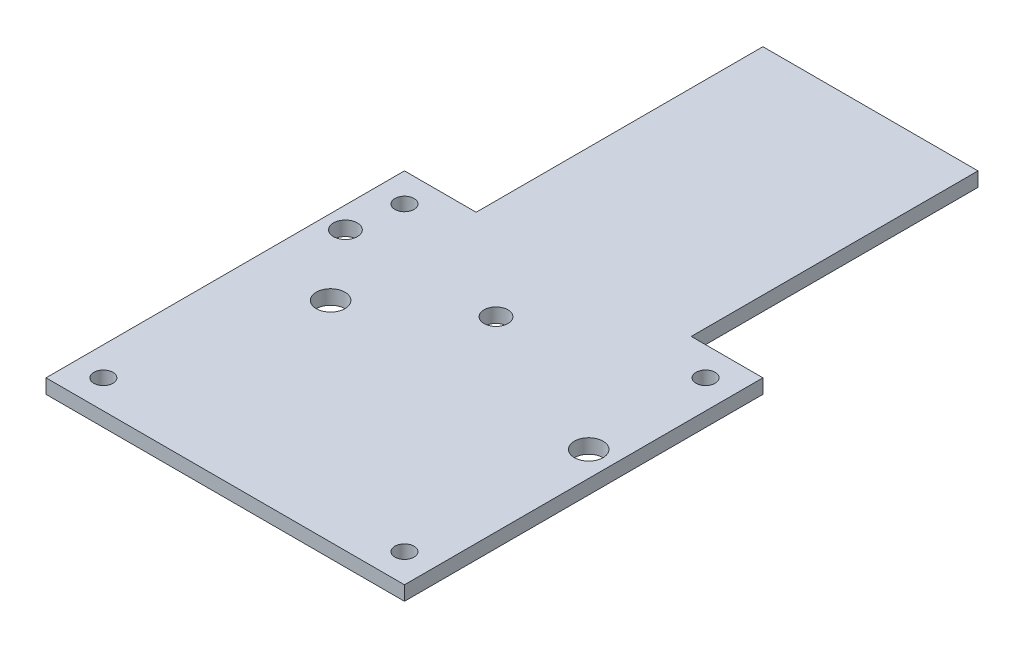
ISO-10303-21;
HEADER;
FILE_DESCRIPTION(('STEP AP214'),'2;1');
FILE_NAME('part.step','',(''),(''),'','','');
FILE_SCHEMA(('AUTOMOTIVE_DESIGN { 1 0 10303 214 1 1 1 1 }'));
ENDSEC;
DATA;
#1=APPLICATION_CONTEXT('core data for automotive mechanical design processes');
#2=APPLICATION_PROTOCOL_DEFINITION('international standard','automotive_design',2000,#1);
#3=PRODUCT_CONTEXT('',#1,'mechanical');
#4=PRODUCT('Part','Part','',(#3));
#5=PRODUCT_RELATED_PRODUCT_CATEGORY('part','',(#4));
#6=PRODUCT_DEFINITION_FORMATION('','',#4);
#7=PRODUCT_DEFINITION_CONTEXT('part definition',#1,'design');
#8=PRODUCT_DEFINITION('design','',#6,#7);
#9=PRODUCT_DEFINITION_SHAPE('','',#8);
#10=(LENGTH_UNIT() NAMED_UNIT(*) SI_UNIT(.MILLI.,.METRE.));
#11=(NAMED_UNIT(*) PLANE_ANGLE_UNIT() SI_UNIT($,.RADIAN.));
#12=(NAMED_UNIT(*) SI_UNIT($,.STERADIAN.) SOLID_ANGLE_UNIT());
#13=UNCERTAINTY_MEASURE_WITH_UNIT(LENGTH_MEASURE(1.E-05),#10,'distance_accuracy_value','');
#14=(GEOMETRIC_REPRESENTATION_CONTEXT(3) GLOBAL_UNCERTAINTY_ASSIGNED_CONTEXT((#13)) GLOBAL_UNIT_ASSIGNED_CONTEXT((#10,
#11,#12)) REPRESENTATION_CONTEXT('',''));
#15=CARTESIAN_POINT('',(0.,0.,0.));
#16=DIRECTION('',(0.,0.,1.));
#17=DIRECTION('',(1.,0.,0.));
#18=AXIS2_PLACEMENT_3D('',#15,#16,#17);
#19=CARTESIAN_POINT('',(0.,3.,0.));
#20=DIRECTION('',(0.,-1.,0.));
#21=DIRECTION('',(0.,0.,-1.));
#22=AXIS2_PLACEMENT_3D('',#19,#20,#21);
#23=PLANE('',#22);
#24=DIRECTION('',(0.,0.,-1.));
#25=VECTOR('',#24,1.);
#26=CARTESIAN_POINT('',(37.5,3.,37.5));
#27=LINE('',#26,#25);
#28=CARTESIAN_POINT('',(37.5,3.,37.5));
#29=VERTEX_POINT('',#28);
#30=CARTESIAN_POINT('',(37.5,3.,-37.5));
#31=VERTEX_POINT('',#30);
#32=EDGE_CURVE('E145',#29,#31,#27,.T.);
#33=ORIENTED_EDGE('',*,*,#32,.T.);
#34=DIRECTION('',(-1.,0.,0.));
#35=VECTOR('',#34,1.);
#36=CARTESIAN_POINT('',(22.5,3.,-37.5));
#37=LINE('',#36,#35);
#38=CARTESIAN_POINT('',(22.5,3.,-37.5));
#39=VERTEX_POINT('',#38);
#40=EDGE_CURVE('E93',#31,#39,#37,.T.);
#41=ORIENTED_EDGE('',*,*,#40,.T.);
#42=DIRECTION('',(0.,0.,-1.));
#43=VECTOR('',#42,1.);
#44=CARTESIAN_POINT('',(22.5,3.,-97.5));
#45=LINE('',#44,#43);
#46=CARTESIAN_POINT('',(22.5,3.,-97.5));
#47=VERTEX_POINT('',#46);
#48=EDGE_CURVE('E160',#39,#47,#45,.T.);
#49=ORIENTED_EDGE('',*,*,#48,.T.);
#50=DIRECTION('',(-1.,0.,0.));
#51=VECTOR('',#50,1.);
#52=CARTESIAN_POINT('',(-22.5,3.,-97.5));
#53=LINE('',#52,#51);
#54=CARTESIAN_POINT('',(-22.5,3.,-97.5));
#55=VERTEX_POINT('',#54);
#56=EDGE_CURVE('E173',#47,#55,#53,.T.);
#57=ORIENTED_EDGE('',*,*,#56,.T.);
#58=DIRECTION('',(0.,0.,1.));
#59=VECTOR('',#58,1.);
#60=CARTESIAN_POINT('',(-22.5,3.,-97.5));
#61=LINE('',#60,#59);
#62=CARTESIAN_POINT('',(-22.5,3.,-37.5));
#63=VERTEX_POINT('',#62);
#64=EDGE_CURVE('E112',#55,#63,#61,.T.);
#65=ORIENTED_EDGE('',*,*,#64,.T.);
#66=DIRECTION('',(-1.,0.,0.));
#67=VECTOR('',#66,1.);
#68=CARTESIAN_POINT('',(-37.5,3.,-37.5));
#69=LINE('',#68,#67);
#70=CARTESIAN_POINT('',(-37.5,3.,-37.5));
#71=VERTEX_POINT('',#70);
#72=EDGE_CURVE('E106',#63,#71,#69,.T.);
#73=ORIENTED_EDGE('',*,*,#72,.T.);
#74=DIRECTION('',(0.,0.,1.));
#75=VECTOR('',#74,1.);
#76=CARTESIAN_POINT('',(-37.5,3.,37.5));
#77=LINE('',#76,#75);
#78=CARTESIAN_POINT('',(-37.5,3.,37.5));
#79=VERTEX_POINT('',#78);
#80=EDGE_CURVE('E110',#71,#79,#77,.T.);
#81=ORIENTED_EDGE('',*,*,#80,.T.);
#82=DIRECTION('',(1.,0.,0.));
#83=VECTOR('',#82,1.);
#84=CARTESIAN_POINT('',(-37.5,3.,37.5));
#85=LINE('',#84,#83);
#86=EDGE_CURVE('E50',#79,#29,#85,.T.);
#87=ORIENTED_EDGE('',*,*,#86,.T.);
#88=EDGE_LOOP('',(#33,#41,#49,#57,#65,#73,#81,#87));
#89=FACE_BOUND('',#88,.T.);
#90=CARTESIAN_POINT('',(31.5,3.,-31.5));
#91=DIRECTION('',(0.,1.,0.));
#92=DIRECTION('',(0.,0.,1.));
#93=AXIS2_PLACEMENT_3D('',#90,#91,#92);
#94=CIRCLE('',#93,2.);
#95=CARTESIAN_POINT('',(31.5,3.,-29.5));
#96=VERTEX_POINT('',#95);
#97=EDGE_CURVE('E134',#96,#96,#94,.T.);
#98=ORIENTED_EDGE('',*,*,#97,.F.);
#99=EDGE_LOOP('',(#98));
#100=FACE_BOUND('',#99,.T.);
#101=CARTESIAN_POINT('',(31.5,3.,31.5));
#102=DIRECTION('',(0.,1.,0.));
#103=DIRECTION('',(0.,0.,1.));
#104=AXIS2_PLACEMENT_3D('',#101,#102,#103);
#105=CIRCLE('',#104,2.00000000000001);
#106=CARTESIAN_POINT('',(31.5,3.,33.5));
#107=VERTEX_POINT('',#106);
#108=EDGE_CURVE('E182',#107,#107,#105,.T.);
#109=ORIENTED_EDGE('',*,*,#108,.F.);
#110=EDGE_LOOP('',(#109));
#111=FACE_BOUND('',#110,.T.);
#112=CARTESIAN_POINT('',(-31.5,3.,31.5));
#113=DIRECTION('',(0.,1.,0.));
#114=DIRECTION('',(0.,0.,1.));
#115=AXIS2_PLACEMENT_3D('',#112,#113,#114);
#116=CIRCLE('',#115,2.00000000000001);
#117=CARTESIAN_POINT('',(-31.5,3.,33.5));
#118=VERTEX_POINT('',#117);
#119=EDGE_CURVE('E188',#118,#118,#116,.T.);
#120=ORIENTED_EDGE('',*,*,#119,.F.);
#121=EDGE_LOOP('',(#120));
#122=FACE_BOUND('',#121,.T.);
#123=CARTESIAN_POINT('',(-31.5,3.,-31.5));
#124=DIRECTION('',(0.,1.,0.));
#125=DIRECTION('',(0.,0.,1.));
#126=AXIS2_PLACEMENT_3D('',#123,#124,#125);
#127=CIRCLE('',#126,2.00000000000001);
#128=CARTESIAN_POINT('',(-31.5,3.,-29.5));
#129=VERTEX_POINT('',#128);
#130=EDGE_CURVE('E194',#129,#129,#127,.T.);
#131=ORIENTED_EDGE('',*,*,#130,.F.);
#132=EDGE_LOOP('',(#131));
#133=FACE_BOUND('',#132,.T.);
#134=CARTESIAN_POINT('',(32.25,3.,-6.29999999999999));
#135=DIRECTION('',(0.,1.,0.));
#136=DIRECTION('',(0.,0.,1.));
#137=AXIS2_PLACEMENT_3D('',#134,#135,#136);
#138=CIRCLE('',#137,3.);
#139=CARTESIAN_POINT('',(32.25,3.,-3.29999999999999));
#140=VERTEX_POINT('',#139);
#141=EDGE_CURVE('E200',#140,#140,#138,.T.);
#142=ORIENTED_EDGE('',*,*,#141,.F.);
#143=EDGE_LOOP('',(#142));
#144=FACE_BOUND('',#143,.T.);
#145=CARTESIAN_POINT('',(-21.75,3.,-6.29999999999999));
#146=DIRECTION('',(0.,1.,0.));
#147=DIRECTION('',(0.,0.,1.));
#148=AXIS2_PLACEMENT_3D('',#145,#146,#147);
#149=CIRCLE('',#148,3.);
#150=CARTESIAN_POINT('',(-21.75,3.,-3.29999999999999));
#151=VERTEX_POINT('',#150);
#152=EDGE_CURVE('E206',#151,#151,#149,.T.);
#153=ORIENTED_EDGE('',*,*,#152,.F.);
#154=EDGE_LOOP('',(#153));
#155=FACE_BOUND('',#154,.T.);
#156=CARTESIAN_POINT('',(-33.,3.,-20.65));
#157=DIRECTION('',(0.,1.,0.));
#158=DIRECTION('',(0.,0.,1.));
#159=AXIS2_PLACEMENT_3D('',#156,#157,#158);
#160=CIRCLE('',#159,2.5);
#161=CARTESIAN_POINT('',(-33.,3.,-18.15));
#162=VERTEX_POINT('',#161);
#163=EDGE_CURVE('E212',#162,#162,#160,.T.);
#164=ORIENTED_EDGE('',*,*,#163,.F.);
#165=EDGE_LOOP('',(#164));
#166=FACE_BOUND('',#165,.T.);
#167=CARTESIAN_POINT('',(-1.50000000000001,3.,-20.65));
#168=DIRECTION('',(0.,1.,0.));
#169=DIRECTION('',(0.,0.,1.));
#170=AXIS2_PLACEMENT_3D('',#167,#168,#169);
#171=CIRCLE('',#170,2.5);
#172=CARTESIAN_POINT('',(-1.50000000000001,3.,-18.15));
#173=VERTEX_POINT('',#172);
#174=EDGE_CURVE('E218',#173,#173,#171,.T.);
#175=ORIENTED_EDGE('',*,*,#174,.F.);
#176=EDGE_LOOP('',(#175));
#177=FACE_BOUND('',#176,.T.);
#178=ADVANCED_FACE('F33',(#89,#100,#111,#122,#133,#144,#155,#166,#177),#23,.F.);
#179=CARTESIAN_POINT('',(0.,0.,0.));
#180=DIRECTION('',(0.,-1.,0.));
#181=DIRECTION('',(0.,0.,-1.));
#182=AXIS2_PLACEMENT_3D('',#179,#180,#181);
#183=PLANE('',#182);
#184=CARTESIAN_POINT('',(-33.,0.,-20.65));
#185=DIRECTION('',(0.,1.,0.));
#186=DIRECTION('',(0.,0.,1.));
#187=AXIS2_PLACEMENT_3D('',#184,#185,#186);
#188=CIRCLE('',#187,2.5);
#189=CARTESIAN_POINT('',(-33.,0.,-18.15));
#190=VERTEX_POINT('',#189);
#191=EDGE_CURVE('E215',#190,#190,#188,.T.);
#192=ORIENTED_EDGE('',*,*,#191,.T.);
#193=EDGE_LOOP('',(#192));
#194=FACE_BOUND('',#193,.T.);
#195=CARTESIAN_POINT('',(32.25,0.,-6.29999999999999));
#196=DIRECTION('',(0.,1.,0.));
#197=DIRECTION('',(0.,0.,1.));
#198=AXIS2_PLACEMENT_3D('',#195,#196,#197);
#199=CIRCLE('',#198,3.);
#200=CARTESIAN_POINT('',(32.25,0.,-3.29999999999999));
#201=VERTEX_POINT('',#200);
#202=EDGE_CURVE('E203',#201,#201,#199,.T.);
#203=ORIENTED_EDGE('',*,*,#202,.T.);
#204=EDGE_LOOP('',(#203));
#205=FACE_BOUND('',#204,.T.);
#206=CARTESIAN_POINT('',(-31.5,0.,31.5));
#207=DIRECTION('',(0.,1.,0.));
#208=DIRECTION('',(0.,0.,1.));
#209=AXIS2_PLACEMENT_3D('',#206,#207,#208);
#210=CIRCLE('',#209,2.00000000000001);
#211=CARTESIAN_POINT('',(-31.5,0.,33.5));
#212=VERTEX_POINT('',#211);
#213=EDGE_CURVE('E191',#212,#212,#210,.T.);
#214=ORIENTED_EDGE('',*,*,#213,.T.);
#215=EDGE_LOOP('',(#214));
#216=FACE_BOUND('',#215,.T.);
#217=CARTESIAN_POINT('',(31.5,0.,-31.5));
#218=DIRECTION('',(0.,1.,0.));
#219=DIRECTION('',(0.,0.,1.));
#220=AXIS2_PLACEMENT_3D('',#217,#218,#219);
#221=CIRCLE('',#220,2.);
#222=CARTESIAN_POINT('',(31.5,0.,-29.5));
#223=VERTEX_POINT('',#222);
#224=EDGE_CURVE('E179',#223,#223,#221,.T.);
#225=ORIENTED_EDGE('',*,*,#224,.T.);
#226=EDGE_LOOP('',(#225));
#227=FACE_BOUND('',#226,.T.);
#228=DIRECTION('',(0.,0.,-1.));
#229=VECTOR('',#228,1.);
#230=CARTESIAN_POINT('',(37.5,0.,37.5));
#231=LINE('',#230,#229);
#232=CARTESIAN_POINT('',(37.5,0.,37.5));
#233=VERTEX_POINT('',#232);
#234=CARTESIAN_POINT('',(37.5,0.,-37.5));
#235=VERTEX_POINT('',#234);
#236=EDGE_CURVE('E130',#233,#235,#231,.T.);
#237=ORIENTED_EDGE('',*,*,#236,.F.);
#238=DIRECTION('',(1.,0.,0.));
#239=VECTOR('',#238,1.);
#240=CARTESIAN_POINT('',(-37.5,0.,37.5));
#241=LINE('',#240,#239);
#242=CARTESIAN_POINT('',(-37.5,0.,37.5));
#243=VERTEX_POINT('',#242);
#244=EDGE_CURVE('E85',#243,#233,#241,.T.);
#245=ORIENTED_EDGE('',*,*,#244,.F.);
#246=DIRECTION('',(0.,0.,1.));
#247=VECTOR('',#246,1.);
#248=CARTESIAN_POINT('',(-37.5,0.,37.5));
#249=LINE('',#248,#247);
#250=CARTESIAN_POINT('',(-37.5,0.,-37.5));
#251=VERTEX_POINT('',#250);
#252=EDGE_CURVE('E79',#251,#243,#249,.T.);
#253=ORIENTED_EDGE('',*,*,#252,.F.);
#254=DIRECTION('',(-1.,0.,0.));
#255=VECTOR('',#254,1.);
#256=CARTESIAN_POINT('',(-37.5,0.,-37.5));
#257=LINE('',#256,#255);
#258=CARTESIAN_POINT('',(-22.5,0.,-37.5));
#259=VERTEX_POINT('',#258);
#260=EDGE_CURVE('E120',#259,#251,#257,.T.);
#261=ORIENTED_EDGE('',*,*,#260,.F.);
#262=DIRECTION('',(0.,0.,1.));
#263=VECTOR('',#262,1.);
#264=CARTESIAN_POINT('',(-22.5,0.,-97.5));
#265=LINE('',#264,#263);
#266=CARTESIAN_POINT('',(-22.5,0.,-97.5));
#267=VERTEX_POINT('',#266);
#268=EDGE_CURVE('E140',#267,#259,#265,.T.);
#269=ORIENTED_EDGE('',*,*,#268,.F.);
#270=DIRECTION('',(-1.,0.,0.));
#271=VECTOR('',#270,1.);
#272=CARTESIAN_POINT('',(-22.5,0.,-97.5));
#273=LINE('',#272,#271);
#274=CARTESIAN_POINT('',(22.5,0.,-97.5));
#275=VERTEX_POINT('',#274);
#276=EDGE_CURVE('E138',#275,#267,#273,.T.);
#277=ORIENTED_EDGE('',*,*,#276,.F.);
#278=DIRECTION('',(0.,0.,-1.));
#279=VECTOR('',#278,1.);
#280=CARTESIAN_POINT('',(22.5,0.,-97.5));
#281=LINE('',#280,#279);
#282=CARTESIAN_POINT('',(22.5,0.,-37.5));
#283=VERTEX_POINT('',#282);
#284=EDGE_CURVE('E136',#283,#275,#281,.T.);
#285=ORIENTED_EDGE('',*,*,#284,.F.);
#286=DIRECTION('',(-1.,0.,0.));
#287=VECTOR('',#286,1.);
#288=CARTESIAN_POINT('',(22.5,0.,-37.5));
#289=LINE('',#288,#287);
#290=EDGE_CURVE('E133',#235,#283,#289,.T.);
#291=ORIENTED_EDGE('',*,*,#290,.F.);
#292=EDGE_LOOP('',(#237,#245,#253,#261,#269,#277,#285,#291));
#293=FACE_BOUND('',#292,.T.);
#294=CARTESIAN_POINT('',(31.5,0.,31.5));
#295=DIRECTION('',(0.,1.,0.));
#296=DIRECTION('',(0.,0.,1.));
#297=AXIS2_PLACEMENT_3D('',#294,#295,#296);
#298=CIRCLE('',#297,2.00000000000001);
#299=CARTESIAN_POINT('',(31.5,0.,33.5));
#300=VERTEX_POINT('',#299);
#301=EDGE_CURVE('E185',#300,#300,#298,.T.);
#302=ORIENTED_EDGE('',*,*,#301,.T.);
#303=EDGE_LOOP('',(#302));
#304=FACE_BOUND('',#303,.T.);
#305=CARTESIAN_POINT('',(-31.5,0.,-31.5));
#306=DIRECTION('',(0.,1.,0.));
#307=DIRECTION('',(0.,0.,1.));
#308=AXIS2_PLACEMENT_3D('',#305,#306,#307);
#309=CIRCLE('',#308,2.00000000000001);
#310=CARTESIAN_POINT('',(-31.5,0.,-29.5));
#311=VERTEX_POINT('',#310);
#312=EDGE_CURVE('E197',#311,#311,#309,.T.);
#313=ORIENTED_EDGE('',*,*,#312,.T.);
#314=EDGE_LOOP('',(#313));
#315=FACE_BOUND('',#314,.T.);
#316=CARTESIAN_POINT('',(-21.75,0.,-6.29999999999999));
#317=DIRECTION('',(0.,1.,0.));
#318=DIRECTION('',(0.,0.,1.));
#319=AXIS2_PLACEMENT_3D('',#316,#317,#318);
#320=CIRCLE('',#319,3.);
#321=CARTESIAN_POINT('',(-21.75,0.,-3.29999999999999));
#322=VERTEX_POINT('',#321);
#323=EDGE_CURVE('E209',#322,#322,#320,.T.);
#324=ORIENTED_EDGE('',*,*,#323,.T.);
#325=EDGE_LOOP('',(#324));
#326=FACE_BOUND('',#325,.T.);
#327=CARTESIAN_POINT('',(-1.50000000000001,0.,-20.65));
#328=DIRECTION('',(0.,1.,0.));
#329=DIRECTION('',(0.,0.,1.));
#330=AXIS2_PLACEMENT_3D('',#327,#328,#329);
#331=CIRCLE('',#330,2.5);
#332=CARTESIAN_POINT('',(-1.50000000000001,0.,-18.15));
#333=VERTEX_POINT('',#332);
#334=EDGE_CURVE('E221',#333,#333,#331,.T.);
#335=ORIENTED_EDGE('',*,*,#334,.T.);
#336=EDGE_LOOP('',(#335));
#337=FACE_BOUND('',#336,.T.);
#338=ADVANCED_FACE('F164',(#194,#205,#216,#227,#293,#304,#315,#326,#337),#183,.T.);
#339=CARTESIAN_POINT('',(37.5,3.,37.5));
#340=DIRECTION('',(-1.,0.,0.));
#341=DIRECTION('',(0.,0.,1.));
#342=AXIS2_PLACEMENT_3D('',#339,#340,#341);
#343=PLANE('',#342);
#344=ORIENTED_EDGE('',*,*,#236,.T.);
#345=DIRECTION('',(0.,-1.,0.));
#346=VECTOR('',#345,1.);
#347=CARTESIAN_POINT('',(37.5,3.,-37.5));
#348=LINE('',#347,#346);
#349=EDGE_CURVE('E11',#31,#235,#348,.T.);
#350=ORIENTED_EDGE('',*,*,#349,.F.);
#351=ORIENTED_EDGE('',*,*,#32,.F.);
#352=DIRECTION('',(0.,-1.,0.));
#353=VECTOR('',#352,1.);
#354=CARTESIAN_POINT('',(37.5,3.,37.5));
#355=LINE('',#354,#353);
#356=EDGE_CURVE('E126',#29,#233,#355,.T.);
#357=ORIENTED_EDGE('',*,*,#356,.T.);
#358=EDGE_LOOP('',(#344,#350,#351,#357));
#359=FACE_BOUND('',#358,.T.);
#360=ADVANCED_FACE('F35',(#359),#343,.F.);
#361=CARTESIAN_POINT('',(22.5,3.,-37.5));
#362=DIRECTION('',(0.,0.,1.));
#363=DIRECTION('',(1.,0.,0.));
#364=AXIS2_PLACEMENT_3D('',#361,#362,#363);
#365=PLANE('',#364);
#366=ORIENTED_EDGE('',*,*,#290,.T.);
#367=DIRECTION('',(0.,-1.,0.));
#368=VECTOR('',#367,1.);
#369=CARTESIAN_POINT('',(22.5,3.,-37.5));
#370=LINE('',#369,#368);
#371=EDGE_CURVE('E42',#39,#283,#370,.T.);
#372=ORIENTED_EDGE('',*,*,#371,.F.);
#373=ORIENTED_EDGE('',*,*,#40,.F.);
#374=ORIENTED_EDGE('',*,*,#349,.T.);
#375=EDGE_LOOP('',(#366,#372,#373,#374));
#376=FACE_BOUND('',#375,.T.);
#377=ADVANCED_FACE('F253',(#376),#365,.F.);
#378=CARTESIAN_POINT('',(22.5,3.,-97.5));
#379=DIRECTION('',(-1.,0.,0.));
#380=DIRECTION('',(0.,0.,1.));
#381=AXIS2_PLACEMENT_3D('',#378,#379,#380);
#382=PLANE('',#381);
#383=ORIENTED_EDGE('',*,*,#284,.T.);
#384=DIRECTION('',(0.,-1.,0.));
#385=VECTOR('',#384,1.);
#386=CARTESIAN_POINT('',(22.5,3.,-97.5));
#387=LINE('',#386,#385);
#388=EDGE_CURVE('E152',#47,#275,#387,.T.);
#389=ORIENTED_EDGE('',*,*,#388,.F.);
#390=ORIENTED_EDGE('',*,*,#48,.F.);
#391=ORIENTED_EDGE('',*,*,#371,.T.);
#392=EDGE_LOOP('',(#383,#389,#390,#391));
#393=FACE_BOUND('',#392,.T.);
#394=ADVANCED_FACE('F158',(#393),#382,.F.);
#395=CARTESIAN_POINT('',(-22.5,3.,-97.5));
#396=DIRECTION('',(0.,0.,1.));
#397=DIRECTION('',(1.,0.,0.));
#398=AXIS2_PLACEMENT_3D('',#395,#396,#397);
#399=PLANE('',#398);
#400=ORIENTED_EDGE('',*,*,#276,.T.);
#401=DIRECTION('',(0.,-1.,0.));
#402=VECTOR('',#401,1.);
#403=CARTESIAN_POINT('',(-22.5,3.,-97.5));
#404=LINE('',#403,#402);
#405=EDGE_CURVE('E149',#55,#267,#404,.T.);
#406=ORIENTED_EDGE('',*,*,#405,.F.);
#407=ORIENTED_EDGE('',*,*,#56,.F.);
#408=ORIENTED_EDGE('',*,*,#388,.T.);
#409=EDGE_LOOP('',(#400,#406,#407,#408));
#410=FACE_BOUND('',#409,.T.);
#411=ADVANCED_FACE('F169',(#410),#399,.F.);
#412=CARTESIAN_POINT('',(-22.5,3.,-97.5));
#413=DIRECTION('',(1.,0.,0.));
#414=DIRECTION('',(0.,0.,-1.));
#415=AXIS2_PLACEMENT_3D('',#412,#413,#414);
#416=PLANE('',#415);
#417=ORIENTED_EDGE('',*,*,#268,.T.);
#418=DIRECTION('',(0.,-1.,0.));
#419=VECTOR('',#418,1.);
#420=CARTESIAN_POINT('',(-22.5,3.,-37.5));
#421=LINE('',#420,#419);
#422=EDGE_CURVE('E121',#63,#259,#421,.T.);
#423=ORIENTED_EDGE('',*,*,#422,.F.);
#424=ORIENTED_EDGE('',*,*,#64,.F.);
#425=ORIENTED_EDGE('',*,*,#405,.T.);
#426=EDGE_LOOP('',(#417,#423,#424,#425));
#427=FACE_BOUND('',#426,.T.);
#428=ADVANCED_FACE('F172',(#427),#416,.F.);
#429=CARTESIAN_POINT('',(-37.5,3.,-37.5));
#430=DIRECTION('',(0.,0.,1.));
#431=DIRECTION('',(1.,0.,0.));
#432=AXIS2_PLACEMENT_3D('',#429,#430,#431);
#433=PLANE('',#432);
#434=ORIENTED_EDGE('',*,*,#260,.T.);
#435=DIRECTION('',(0.,-1.,0.));
#436=VECTOR('',#435,1.);
#437=CARTESIAN_POINT('',(-37.5,3.,-37.5));
#438=LINE('',#437,#436);
#439=EDGE_CURVE('E117',#71,#251,#438,.T.);
#440=ORIENTED_EDGE('',*,*,#439,.F.);
#441=ORIENTED_EDGE('',*,*,#72,.F.);
#442=ORIENTED_EDGE('',*,*,#422,.T.);
#443=EDGE_LOOP('',(#434,#440,#441,#442));
#444=FACE_BOUND('',#443,.T.);
#445=ADVANCED_FACE('F118',(#444),#433,.F.);
#446=CARTESIAN_POINT('',(-37.5,3.,37.5));
#447=DIRECTION('',(1.,0.,0.));
#448=DIRECTION('',(0.,0.,-1.));
#449=AXIS2_PLACEMENT_3D('',#446,#447,#448);
#450=PLANE('',#449);
#451=ORIENTED_EDGE('',*,*,#252,.T.);
#452=DIRECTION('',(0.,-1.,0.));
#453=VECTOR('',#452,1.);
#454=CARTESIAN_POINT('',(-37.5,3.,37.5));
#455=LINE('',#454,#453);
#456=EDGE_CURVE('E122',#79,#243,#455,.T.);
#457=ORIENTED_EDGE('',*,*,#456,.F.);
#458=ORIENTED_EDGE('',*,*,#80,.F.);
#459=ORIENTED_EDGE('',*,*,#439,.T.);
#460=EDGE_LOOP('',(#451,#457,#458,#459));
#461=FACE_BOUND('',#460,.T.);
#462=ADVANCED_FACE('F124',(#461),#450,.F.);
#463=CARTESIAN_POINT('',(-37.5,3.,37.5));
#464=DIRECTION('',(0.,0.,-1.));
#465=DIRECTION('',(-1.,0.,0.));
#466=AXIS2_PLACEMENT_3D('',#463,#464,#465);
#467=PLANE('',#466);
#468=ORIENTED_EDGE('',*,*,#244,.T.);
#469=ORIENTED_EDGE('',*,*,#356,.F.);
#470=ORIENTED_EDGE('',*,*,#86,.F.);
#471=ORIENTED_EDGE('',*,*,#456,.T.);
#472=EDGE_LOOP('',(#468,#469,#470,#471));
#473=FACE_BOUND('',#472,.T.);
#474=ADVANCED_FACE('F241',(#473),#467,.F.);
#475=CARTESIAN_POINT('',(31.5,3.,-31.5));
#476=DIRECTION('',(0.,-1.,0.));
#477=DIRECTION('',(0.,0.,-1.));
#478=AXIS2_PLACEMENT_3D('',#475,#476,#477);
#479=CYLINDRICAL_SURFACE('',#478,2.);
#480=ORIENTED_EDGE('',*,*,#97,.T.);
#481=EDGE_LOOP('',(#480));
#482=FACE_BOUND('',#481,.T.);
#483=ORIENTED_EDGE('',*,*,#224,.F.);
#484=EDGE_LOOP('',(#483));
#485=FACE_BOUND('',#484,.T.);
#486=ADVANCED_FACE('F238',(#482,#485),#479,.F.);
#487=CARTESIAN_POINT('',(31.5,3.,31.5));
#488=DIRECTION('',(0.,-1.,0.));
#489=DIRECTION('',(0.,0.,-1.));
#490=AXIS2_PLACEMENT_3D('',#487,#488,#489);
#491=CYLINDRICAL_SURFACE('',#490,2.00000000000001);
#492=ORIENTED_EDGE('',*,*,#108,.T.);
#493=EDGE_LOOP('',(#492));
#494=FACE_BOUND('',#493,.T.);
#495=ORIENTED_EDGE('',*,*,#301,.F.);
#496=EDGE_LOOP('',(#495));
#497=FACE_BOUND('',#496,.T.);
#498=ADVANCED_FACE('F317',(#494,#497),#491,.F.);
#499=CARTESIAN_POINT('',(-31.5,3.,31.5));
#500=DIRECTION('',(0.,-1.,0.));
#501=DIRECTION('',(0.,0.,-1.));
#502=AXIS2_PLACEMENT_3D('',#499,#500,#501);
#503=CYLINDRICAL_SURFACE('',#502,2.00000000000001);
#504=ORIENTED_EDGE('',*,*,#119,.T.);
#505=EDGE_LOOP('',(#504));
#506=FACE_BOUND('',#505,.T.);
#507=ORIENTED_EDGE('',*,*,#213,.F.);
#508=EDGE_LOOP('',(#507));
#509=FACE_BOUND('',#508,.T.);
#510=ADVANCED_FACE('F325',(#506,#509),#503,.F.);
#511=CARTESIAN_POINT('',(-31.5,3.,-31.5));
#512=DIRECTION('',(0.,-1.,0.));
#513=DIRECTION('',(0.,0.,-1.));
#514=AXIS2_PLACEMENT_3D('',#511,#512,#513);
#515=CYLINDRICAL_SURFACE('',#514,2.00000000000001);
#516=ORIENTED_EDGE('',*,*,#130,.T.);
#517=EDGE_LOOP('',(#516));
#518=FACE_BOUND('',#517,.T.);
#519=ORIENTED_EDGE('',*,*,#312,.F.);
#520=EDGE_LOOP('',(#519));
#521=FACE_BOUND('',#520,.T.);
#522=ADVANCED_FACE('F333',(#518,#521),#515,.F.);
#523=CARTESIAN_POINT('',(32.25,3.,-6.29999999999999));
#524=DIRECTION('',(0.,-1.,0.));
#525=DIRECTION('',(0.,0.,-1.));
#526=AXIS2_PLACEMENT_3D('',#523,#524,#525);
#527=CYLINDRICAL_SURFACE('',#526,3.);
#528=ORIENTED_EDGE('',*,*,#141,.T.);
#529=EDGE_LOOP('',(#528));
#530=FACE_BOUND('',#529,.T.);
#531=ORIENTED_EDGE('',*,*,#202,.F.);
#532=EDGE_LOOP('',(#531));
#533=FACE_BOUND('',#532,.T.);
#534=ADVANCED_FACE('F342',(#530,#533),#527,.F.);
#535=CARTESIAN_POINT('',(-21.75,3.,-6.29999999999999));
#536=DIRECTION('',(0.,-1.,0.));
#537=DIRECTION('',(0.,0.,-1.));
#538=AXIS2_PLACEMENT_3D('',#535,#536,#537);
#539=CYLINDRICAL_SURFACE('',#538,3.);
#540=ORIENTED_EDGE('',*,*,#152,.T.);
#541=EDGE_LOOP('',(#540));
#542=FACE_BOUND('',#541,.T.);
#543=ORIENTED_EDGE('',*,*,#323,.F.);
#544=EDGE_LOOP('',(#543));
#545=FACE_BOUND('',#544,.T.);
#546=ADVANCED_FACE('F351',(#542,#545),#539,.F.);
#547=CARTESIAN_POINT('',(-33.,3.,-20.65));
#548=DIRECTION('',(0.,-1.,0.));
#549=DIRECTION('',(0.,0.,-1.));
#550=AXIS2_PLACEMENT_3D('',#547,#548,#549);
#551=CYLINDRICAL_SURFACE('',#550,2.5);
#552=ORIENTED_EDGE('',*,*,#163,.T.);
#553=EDGE_LOOP('',(#552));
#554=FACE_BOUND('',#553,.T.);
#555=ORIENTED_EDGE('',*,*,#191,.F.);
#556=EDGE_LOOP('',(#555));
#557=FACE_BOUND('',#556,.T.);
#558=ADVANCED_FACE('F360',(#554,#557),#551,.F.);
#559=CARTESIAN_POINT('',(-1.50000000000001,3.,-20.65));
#560=DIRECTION('',(0.,-1.,0.));
#561=DIRECTION('',(0.,0.,-1.));
#562=AXIS2_PLACEMENT_3D('',#559,#560,#561);
#563=CYLINDRICAL_SURFACE('',#562,2.5);
#564=ORIENTED_EDGE('',*,*,#174,.T.);
#565=EDGE_LOOP('',(#564));
#566=FACE_BOUND('',#565,.T.);
#567=ORIENTED_EDGE('',*,*,#334,.F.);
#568=EDGE_LOOP('',(#567));
#569=FACE_BOUND('',#568,.T.);
#570=ADVANCED_FACE('F227',(#566,#569),#563,.F.);
#571=CLOSED_SHELL('',(#178,#338,#360,#377,#394,#411,#428,#445,#462,#474,#486,#498,#510,#522,
#534,#546,#558,#570));
#572=MANIFOLD_SOLID_BREP('B2',#571);
#573=ADVANCED_BREP_SHAPE_REPRESENTATION('',(#18,#572),#14);
#574=SHAPE_DEFINITION_REPRESENTATION(#9,#573);
ENDSEC;
END-ISO-10303-21;
